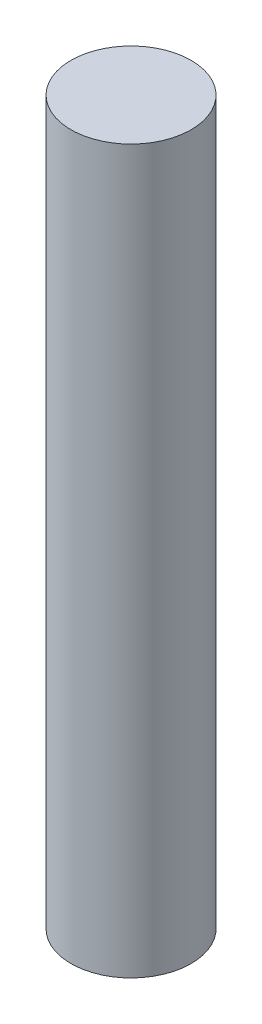
ISO-10303-21;
HEADER;
FILE_DESCRIPTION(('STEP AP214'),'2;1');
FILE_NAME('part.step','',(''),(''),'','','');
FILE_SCHEMA(('AUTOMOTIVE_DESIGN { 1 0 10303 214 1 1 1 1 }'));
ENDSEC;
DATA;
#1=APPLICATION_CONTEXT('core data for automotive mechanical design processes');
#2=APPLICATION_PROTOCOL_DEFINITION('international standard','automotive_design',2000,#1);
#3=PRODUCT_CONTEXT('',#1,'mechanical');
#4=PRODUCT('Part','Part','',(#3));
#5=PRODUCT_RELATED_PRODUCT_CATEGORY('part','',(#4));
#6=PRODUCT_DEFINITION_FORMATION('','',#4);
#7=PRODUCT_DEFINITION_CONTEXT('part definition',#1,'design');
#8=PRODUCT_DEFINITION('design','',#6,#7);
#9=PRODUCT_DEFINITION_SHAPE('','',#8);
#10=(LENGTH_UNIT() NAMED_UNIT(*) SI_UNIT(.MILLI.,.METRE.));
#11=(NAMED_UNIT(*) PLANE_ANGLE_UNIT() SI_UNIT($,.RADIAN.));
#12=(NAMED_UNIT(*) SI_UNIT($,.STERADIAN.) SOLID_ANGLE_UNIT());
#13=UNCERTAINTY_MEASURE_WITH_UNIT(LENGTH_MEASURE(1.E-05),#10,'distance_accuracy_value','');
#14=(GEOMETRIC_REPRESENTATION_CONTEXT(3) GLOBAL_UNCERTAINTY_ASSIGNED_CONTEXT((#13)) GLOBAL_UNIT_ASSIGNED_CONTEXT((#10,
#11,#12)) REPRESENTATION_CONTEXT('',''));
#15=CARTESIAN_POINT('',(0.,0.,0.));
#16=DIRECTION('',(0.,0.,1.));
#17=DIRECTION('',(1.,0.,0.));
#18=AXIS2_PLACEMENT_3D('',#15,#16,#17);
#19=CARTESIAN_POINT('',(0.,76.17,0.));
#20=DIRECTION('',(0.,1.,0.));
#21=DIRECTION('',(0.,0.,1.));
#22=AXIS2_PLACEMENT_3D('',#19,#20,#21);
#23=PLANE('',#22);
#24=CARTESIAN_POINT('',(0.,76.17,0.));
#25=DIRECTION('',(0.,-1.,0.));
#26=DIRECTION('',(0.,0.,-1.));
#27=AXIS2_PLACEMENT_3D('',#24,#25,#26);
#28=CIRCLE('',#27,6.34);
#29=CARTESIAN_POINT('',(0.,76.17,-6.34));
#30=VERTEX_POINT('',#29);
#31=EDGE_CURVE('E18',#30,#30,#28,.T.);
#32=ORIENTED_EDGE('',*,*,#31,.F.);
#33=EDGE_LOOP('',(#32));
#34=FACE_BOUND('',#33,.T.);
#35=ADVANCED_FACE('F15',(#34),#23,.T.);
#36=CARTESIAN_POINT('',(0.,0.,0.));
#37=DIRECTION('',(0.,1.,0.));
#38=DIRECTION('',(0.,0.,1.));
#39=AXIS2_PLACEMENT_3D('',#36,#37,#38);
#40=PLANE('',#39);
#41=CARTESIAN_POINT('',(0.,0.,0.));
#42=DIRECTION('',(0.,-1.,0.));
#43=DIRECTION('',(0.,0.,-1.));
#44=AXIS2_PLACEMENT_3D('',#41,#42,#43);
#45=CIRCLE('',#44,6.34);
#46=CARTESIAN_POINT('',(0.,0.,-6.34));
#47=VERTEX_POINT('',#46);
#48=EDGE_CURVE('E10',#47,#47,#45,.F.);
#49=ORIENTED_EDGE('',*,*,#48,.F.);
#50=EDGE_LOOP('',(#49));
#51=FACE_BOUND('',#50,.T.);
#52=ADVANCED_FACE('F30',(#51),#40,.F.);
#53=CARTESIAN_POINT('',(0.,76.17,0.));
#54=DIRECTION('',(0.,-1.,0.));
#55=DIRECTION('',(0.,0.,-1.));
#56=AXIS2_PLACEMENT_3D('',#53,#54,#55);
#57=CYLINDRICAL_SURFACE('',#56,6.34);
#58=ORIENTED_EDGE('',*,*,#48,.T.);
#59=EDGE_LOOP('',(#58));
#60=FACE_BOUND('',#59,.T.);
#61=ORIENTED_EDGE('',*,*,#31,.T.);
#62=EDGE_LOOP('',(#61));
#63=FACE_BOUND('',#62,.T.);
#64=ADVANCED_FACE('F27',(#60,#63),#57,.T.);
#65=CLOSED_SHELL('',(#35,#52,#64));
#66=MANIFOLD_SOLID_BREP('B1',#65);
#67=ADVANCED_BREP_SHAPE_REPRESENTATION('',(#18,#66),#14);
#68=SHAPE_DEFINITION_REPRESENTATION(#9,#67);
ENDSEC;
END-ISO-10303-21;
